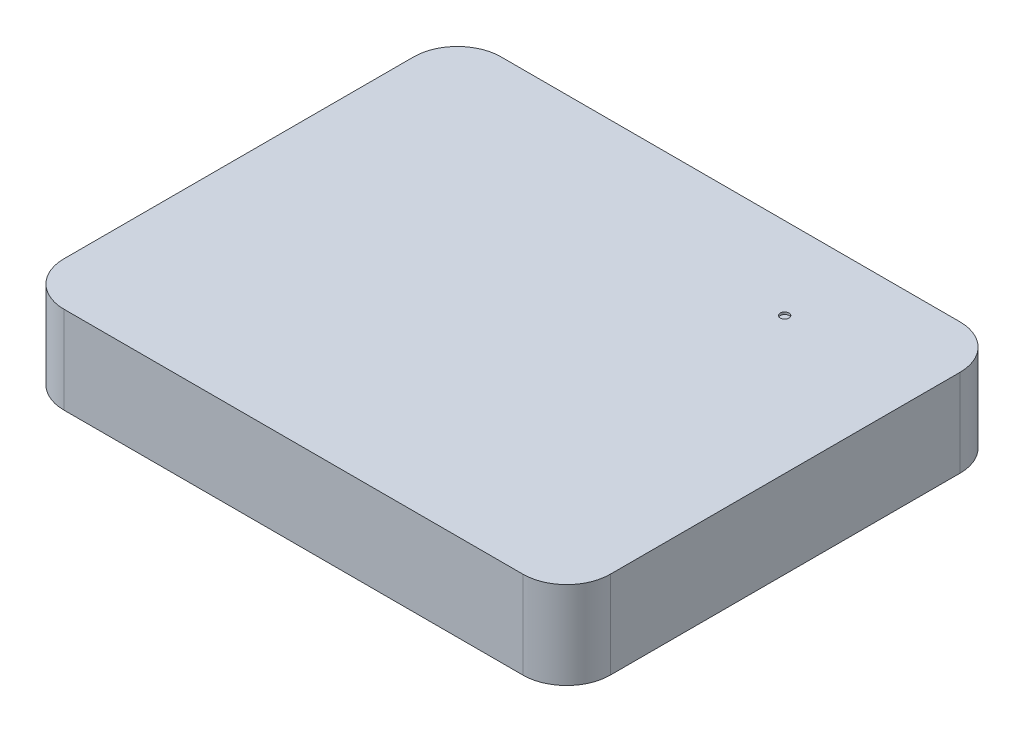
ISO-10303-21;
HEADER;
FILE_DESCRIPTION(('STEP AP214'),'2;1');
FILE_NAME('part.step','',(''),(''),'','','');
FILE_SCHEMA(('AUTOMOTIVE_DESIGN { 1 0 10303 214 1 1 1 1 }'));
ENDSEC;
DATA;
#1=APPLICATION_CONTEXT('core data for automotive mechanical design processes');
#2=APPLICATION_PROTOCOL_DEFINITION('international standard','automotive_design',2000,#1);
#3=PRODUCT_CONTEXT('',#1,'mechanical');
#4=PRODUCT('Part','Part','',(#3));
#5=PRODUCT_RELATED_PRODUCT_CATEGORY('part','',(#4));
#6=PRODUCT_DEFINITION_FORMATION('','',#4);
#7=PRODUCT_DEFINITION_CONTEXT('part definition',#1,'design');
#8=PRODUCT_DEFINITION('design','',#6,#7);
#9=PRODUCT_DEFINITION_SHAPE('','',#8);
#10=(LENGTH_UNIT() NAMED_UNIT(*) SI_UNIT(.MILLI.,.METRE.));
#11=(NAMED_UNIT(*) PLANE_ANGLE_UNIT() SI_UNIT($,.RADIAN.));
#12=(NAMED_UNIT(*) SI_UNIT($,.STERADIAN.) SOLID_ANGLE_UNIT());
#13=UNCERTAINTY_MEASURE_WITH_UNIT(LENGTH_MEASURE(1.E-05),#10,'distance_accuracy_value','');
#14=(GEOMETRIC_REPRESENTATION_CONTEXT(3) GLOBAL_UNCERTAINTY_ASSIGNED_CONTEXT((#13)) GLOBAL_UNIT_ASSIGNED_CONTEXT((#10,
#11,#12)) REPRESENTATION_CONTEXT('',''));
#15=CARTESIAN_POINT('',(0.,0.,0.));
#16=DIRECTION('',(0.,0.,1.));
#17=DIRECTION('',(1.,0.,0.));
#18=AXIS2_PLACEMENT_3D('',#15,#16,#17);
#19=CARTESIAN_POINT('',(-105.,40.,-80.));
#20=DIRECTION('',(0.,-1.,0.));
#21=DIRECTION('',(0.,0.,-1.));
#22=AXIS2_PLACEMENT_3D('',#19,#20,#21);
#23=CYLINDRICAL_SURFACE('',#22,20.);
#24=CARTESIAN_POINT('',(-105.,0.,-80.));
#25=DIRECTION('',(0.,1.,0.));
#26=DIRECTION('',(0.,0.,1.));
#27=AXIS2_PLACEMENT_3D('',#24,#25,#26);
#28=CIRCLE('',#27,20.);
#29=CARTESIAN_POINT('',(-105.,0.,-100.));
#30=VERTEX_POINT('',#29);
#31=CARTESIAN_POINT('',(-125.,0.,-79.9999999999999));
#32=VERTEX_POINT('',#31);
#33=EDGE_CURVE('E129',#30,#32,#28,.T.);
#34=ORIENTED_EDGE('',*,*,#33,.T.);
#35=DIRECTION('',(0.,-1.,0.));
#36=VECTOR('',#35,1.);
#37=CARTESIAN_POINT('',(-125.,40.,-79.9999999999999));
#38=LINE('',#37,#36);
#39=CARTESIAN_POINT('',(-125.,40.,-79.9999999999999));
#40=VERTEX_POINT('',#39);
#41=EDGE_CURVE('E11',#40,#32,#38,.T.);
#42=ORIENTED_EDGE('',*,*,#41,.F.);
#43=CARTESIAN_POINT('',(-105.,40.,-80.));
#44=DIRECTION('',(0.,1.,0.));
#45=DIRECTION('',(0.,0.,1.));
#46=AXIS2_PLACEMENT_3D('',#43,#44,#45);
#47=CIRCLE('',#46,20.);
#48=CARTESIAN_POINT('',(-105.,40.,-100.));
#49=VERTEX_POINT('',#48);
#50=EDGE_CURVE('E144',#49,#40,#47,.T.);
#51=ORIENTED_EDGE('',*,*,#50,.F.);
#52=DIRECTION('',(0.,-1.,0.));
#53=VECTOR('',#52,1.);
#54=CARTESIAN_POINT('',(-105.,40.,-100.));
#55=LINE('',#54,#53);
#56=EDGE_CURVE('E125',#49,#30,#55,.T.);
#57=ORIENTED_EDGE('',*,*,#56,.T.);
#58=EDGE_LOOP('',(#34,#42,#51,#57));
#59=FACE_BOUND('',#58,.T.);
#60=ADVANCED_FACE('F33',(#59),#23,.T.);
#61=CARTESIAN_POINT('',(-125.,40.,79.9999999999999));
#62=DIRECTION('',(1.,0.,0.));
#63=DIRECTION('',(0.,0.,-1.));
#64=AXIS2_PLACEMENT_3D('',#61,#62,#63);
#65=PLANE('',#64);
#66=DIRECTION('',(0.,0.,1.));
#67=VECTOR('',#66,1.);
#68=CARTESIAN_POINT('',(-125.,0.,79.9999999999999));
#69=LINE('',#68,#67);
#70=CARTESIAN_POINT('',(-125.,0.,79.9999999999999));
#71=VERTEX_POINT('',#70);
#72=EDGE_CURVE('E132',#32,#71,#69,.T.);
#73=ORIENTED_EDGE('',*,*,#72,.T.);
#74=DIRECTION('',(0.,-1.,0.));
#75=VECTOR('',#74,1.);
#76=CARTESIAN_POINT('',(-125.,40.,79.9999999999999));
#77=LINE('',#76,#75);
#78=CARTESIAN_POINT('',(-125.,40.,79.9999999999999));
#79=VERTEX_POINT('',#78);
#80=EDGE_CURVE('E41',#79,#71,#77,.T.);
#81=ORIENTED_EDGE('',*,*,#80,.F.);
#82=DIRECTION('',(0.,0.,1.));
#83=VECTOR('',#82,1.);
#84=CARTESIAN_POINT('',(-125.,40.,79.9999999999999));
#85=LINE('',#84,#83);
#86=EDGE_CURVE('E92',#40,#79,#85,.T.);
#87=ORIENTED_EDGE('',*,*,#86,.F.);
#88=ORIENTED_EDGE('',*,*,#41,.T.);
#89=EDGE_LOOP('',(#73,#81,#87,#88));
#90=FACE_BOUND('',#89,.T.);
#91=ADVANCED_FACE('F201',(#90),#65,.F.);
#92=CARTESIAN_POINT('',(-105.,40.,80.));
#93=DIRECTION('',(0.,-1.,0.));
#94=DIRECTION('',(0.,0.,-1.));
#95=AXIS2_PLACEMENT_3D('',#92,#93,#94);
#96=CYLINDRICAL_SURFACE('',#95,20.);
#97=CARTESIAN_POINT('',(-105.,0.,80.));
#98=DIRECTION('',(0.,1.,0.));
#99=DIRECTION('',(0.,0.,-1.));
#100=AXIS2_PLACEMENT_3D('',#97,#98,#99);
#101=CIRCLE('',#100,20.);
#102=CARTESIAN_POINT('',(-105.,0.,100.));
#103=VERTEX_POINT('',#102);
#104=EDGE_CURVE('E135',#71,#103,#101,.T.);
#105=ORIENTED_EDGE('',*,*,#104,.T.);
#106=DIRECTION('',(0.,-1.,0.));
#107=VECTOR('',#106,1.);
#108=CARTESIAN_POINT('',(-105.,40.,100.));
#109=LINE('',#108,#107);
#110=CARTESIAN_POINT('',(-105.,40.,100.));
#111=VERTEX_POINT('',#110);
#112=EDGE_CURVE('E151',#111,#103,#109,.T.);
#113=ORIENTED_EDGE('',*,*,#112,.F.);
#114=CARTESIAN_POINT('',(-105.,40.,80.));
#115=DIRECTION('',(0.,1.,0.));
#116=DIRECTION('',(0.,0.,-1.));
#117=AXIS2_PLACEMENT_3D('',#114,#115,#116);
#118=CIRCLE('',#117,20.);
#119=EDGE_CURVE('E159',#79,#111,#118,.T.);
#120=ORIENTED_EDGE('',*,*,#119,.F.);
#121=ORIENTED_EDGE('',*,*,#80,.T.);
#122=EDGE_LOOP('',(#105,#113,#120,#121));
#123=FACE_BOUND('',#122,.T.);
#124=ADVANCED_FACE('F157',(#123),#96,.T.);
#125=CARTESIAN_POINT('',(105.,40.,100.));
#126=DIRECTION('',(0.,0.,-1.));
#127=DIRECTION('',(-1.,0.,0.));
#128=AXIS2_PLACEMENT_3D('',#125,#126,#127);
#129=PLANE('',#128);
#130=DIRECTION('',(1.,0.,0.));
#131=VECTOR('',#130,1.);
#132=CARTESIAN_POINT('',(105.,0.,100.));
#133=LINE('',#132,#131);
#134=CARTESIAN_POINT('',(105.,0.,100.));
#135=VERTEX_POINT('',#134);
#136=EDGE_CURVE('E137',#103,#135,#133,.T.);
#137=ORIENTED_EDGE('',*,*,#136,.T.);
#138=DIRECTION('',(0.,-1.,0.));
#139=VECTOR('',#138,1.);
#140=CARTESIAN_POINT('',(105.,40.,100.));
#141=LINE('',#140,#139);
#142=CARTESIAN_POINT('',(105.,40.,100.));
#143=VERTEX_POINT('',#142);
#144=EDGE_CURVE('E148',#143,#135,#141,.T.);
#145=ORIENTED_EDGE('',*,*,#144,.F.);
#146=DIRECTION('',(1.,0.,0.));
#147=VECTOR('',#146,1.);
#148=CARTESIAN_POINT('',(105.,40.,100.));
#149=LINE('',#148,#147);
#150=EDGE_CURVE('E171',#111,#143,#149,.T.);
#151=ORIENTED_EDGE('',*,*,#150,.F.);
#152=ORIENTED_EDGE('',*,*,#112,.T.);
#153=EDGE_LOOP('',(#137,#145,#151,#152));
#154=FACE_BOUND('',#153,.T.);
#155=ADVANCED_FACE('F167',(#154),#129,.F.);
#156=CARTESIAN_POINT('',(105.,40.,80.));
#157=DIRECTION('',(0.,-1.,0.));
#158=DIRECTION('',(0.,0.,-1.));
#159=AXIS2_PLACEMENT_3D('',#156,#157,#158);
#160=CYLINDRICAL_SURFACE('',#159,20.);
#161=CARTESIAN_POINT('',(105.,0.,80.));
#162=DIRECTION('',(0.,1.,0.));
#163=DIRECTION('',(0.,0.,1.));
#164=AXIS2_PLACEMENT_3D('',#161,#162,#163);
#165=CIRCLE('',#164,20.);
#166=CARTESIAN_POINT('',(125.,0.,79.9999999999998));
#167=VERTEX_POINT('',#166);
#168=EDGE_CURVE('E139',#135,#167,#165,.T.);
#169=ORIENTED_EDGE('',*,*,#168,.T.);
#170=DIRECTION('',(0.,-1.,0.));
#171=VECTOR('',#170,1.);
#172=CARTESIAN_POINT('',(125.,40.,79.9999999999998));
#173=LINE('',#172,#171);
#174=CARTESIAN_POINT('',(125.,40.,79.9999999999998));
#175=VERTEX_POINT('',#174);
#176=EDGE_CURVE('E120',#175,#167,#173,.T.);
#177=ORIENTED_EDGE('',*,*,#176,.F.);
#178=CARTESIAN_POINT('',(105.,40.,80.));
#179=DIRECTION('',(0.,1.,0.));
#180=DIRECTION('',(0.,0.,1.));
#181=AXIS2_PLACEMENT_3D('',#178,#179,#180);
#182=CIRCLE('',#181,20.);
#183=EDGE_CURVE('E111',#143,#175,#182,.T.);
#184=ORIENTED_EDGE('',*,*,#183,.F.);
#185=ORIENTED_EDGE('',*,*,#144,.T.);
#186=EDGE_LOOP('',(#169,#177,#184,#185));
#187=FACE_BOUND('',#186,.T.);
#188=ADVANCED_FACE('F170',(#187),#160,.T.);
#189=CARTESIAN_POINT('',(125.,40.,79.9999999999998));
#190=DIRECTION('',(-1.,0.,0.));
#191=DIRECTION('',(0.,0.,1.));
#192=AXIS2_PLACEMENT_3D('',#189,#190,#191);
#193=PLANE('',#192);
#194=DIRECTION('',(0.,0.,-1.));
#195=VECTOR('',#194,1.);
#196=CARTESIAN_POINT('',(125.,0.,79.9999999999998));
#197=LINE('',#196,#195);
#198=CARTESIAN_POINT('',(125.,0.,-79.9999999999999));
#199=VERTEX_POINT('',#198);
#200=EDGE_CURVE('E119',#167,#199,#197,.T.);
#201=ORIENTED_EDGE('',*,*,#200,.T.);
#202=DIRECTION('',(0.,-1.,0.));
#203=VECTOR('',#202,1.);
#204=CARTESIAN_POINT('',(125.,40.,-79.9999999999999));
#205=LINE('',#204,#203);
#206=CARTESIAN_POINT('',(125.,40.,-79.9999999999999));
#207=VERTEX_POINT('',#206);
#208=EDGE_CURVE('E116',#207,#199,#205,.T.);
#209=ORIENTED_EDGE('',*,*,#208,.F.);
#210=DIRECTION('',(0.,0.,-1.));
#211=VECTOR('',#210,1.);
#212=CARTESIAN_POINT('',(125.,40.,79.9999999999998));
#213=LINE('',#212,#211);
#214=EDGE_CURVE('E105',#175,#207,#213,.T.);
#215=ORIENTED_EDGE('',*,*,#214,.F.);
#216=ORIENTED_EDGE('',*,*,#176,.T.);
#217=EDGE_LOOP('',(#201,#209,#215,#216));
#218=FACE_BOUND('',#217,.T.);
#219=ADVANCED_FACE('F117',(#218),#193,.F.);
#220=CARTESIAN_POINT('',(105.,40.,-80.));
#221=DIRECTION('',(0.,-1.,0.));
#222=DIRECTION('',(0.,0.,-1.));
#223=AXIS2_PLACEMENT_3D('',#220,#221,#222);
#224=CYLINDRICAL_SURFACE('',#223,20.);
#225=CARTESIAN_POINT('',(105.,0.,-80.));
#226=DIRECTION('',(0.,1.,0.));
#227=DIRECTION('',(0.,0.,1.));
#228=AXIS2_PLACEMENT_3D('',#225,#226,#227);
#229=CIRCLE('',#228,20.);
#230=CARTESIAN_POINT('',(105.,0.,-100.));
#231=VERTEX_POINT('',#230);
#232=EDGE_CURVE('E78',#199,#231,#229,.T.);
#233=ORIENTED_EDGE('',*,*,#232,.T.);
#234=DIRECTION('',(0.,-1.,0.));
#235=VECTOR('',#234,1.);
#236=CARTESIAN_POINT('',(105.,40.,-100.));
#237=LINE('',#236,#235);
#238=CARTESIAN_POINT('',(105.,40.,-100.));
#239=VERTEX_POINT('',#238);
#240=EDGE_CURVE('E121',#239,#231,#237,.T.);
#241=ORIENTED_EDGE('',*,*,#240,.F.);
#242=CARTESIAN_POINT('',(105.,40.,-80.));
#243=DIRECTION('',(0.,1.,0.));
#244=DIRECTION('',(0.,0.,1.));
#245=AXIS2_PLACEMENT_3D('',#242,#243,#244);
#246=CIRCLE('',#245,20.);
#247=EDGE_CURVE('E109',#207,#239,#246,.T.);
#248=ORIENTED_EDGE('',*,*,#247,.F.);
#249=ORIENTED_EDGE('',*,*,#208,.T.);
#250=EDGE_LOOP('',(#233,#241,#248,#249));
#251=FACE_BOUND('',#250,.T.);
#252=ADVANCED_FACE('F123',(#251),#224,.T.);
#253=CARTESIAN_POINT('',(105.,40.,-100.));
#254=DIRECTION('',(0.,0.,1.));
#255=DIRECTION('',(1.,0.,0.));
#256=AXIS2_PLACEMENT_3D('',#253,#254,#255);
#257=PLANE('',#256);
#258=DIRECTION('',(-1.,0.,0.));
#259=VECTOR('',#258,1.);
#260=CARTESIAN_POINT('',(105.,0.,-100.));
#261=LINE('',#260,#259);
#262=EDGE_CURVE('E84',#231,#30,#261,.T.);
#263=ORIENTED_EDGE('',*,*,#262,.T.);
#264=ORIENTED_EDGE('',*,*,#56,.F.);
#265=DIRECTION('',(-1.,0.,0.));
#266=VECTOR('',#265,1.);
#267=CARTESIAN_POINT('',(105.,40.,-100.));
#268=LINE('',#267,#266);
#269=EDGE_CURVE('E49',#239,#49,#268,.T.);
#270=ORIENTED_EDGE('',*,*,#269,.F.);
#271=ORIENTED_EDGE('',*,*,#240,.T.);
#272=EDGE_LOOP('',(#263,#264,#270,#271));
#273=FACE_BOUND('',#272,.T.);
#274=ADVANCED_FACE('F192',(#273),#257,.F.);
#275=CARTESIAN_POINT('',(-105.,40.,-80.));
#276=DIRECTION('',(0.,1.,0.));
#277=DIRECTION('',(0.,0.,1.));
#278=AXIS2_PLACEMENT_3D('',#275,#276,#277);
#279=PLANE('',#278);
#280=CARTESIAN_POINT('',(62.3674592684266,40.,-62.3674592684268));
#281=DIRECTION('',(0.,1.,0.));
#282=DIRECTION('',(0.,0.,1.));
#283=AXIS2_PLACEMENT_3D('',#280,#281,#282);
#284=CIRCLE('',#283,2.);
#285=CARTESIAN_POINT('',(62.3674592684266,40.,-60.3674592684268));
#286=VERTEX_POINT('',#285);
#287=EDGE_CURVE('E177',#286,#286,#284,.T.);
#288=ORIENTED_EDGE('',*,*,#287,.F.);
#289=EDGE_LOOP('',(#288));
#290=FACE_BOUND('',#289,.T.);
#291=ORIENTED_EDGE('',*,*,#50,.T.);
#292=ORIENTED_EDGE('',*,*,#86,.T.);
#293=ORIENTED_EDGE('',*,*,#119,.T.);
#294=ORIENTED_EDGE('',*,*,#150,.T.);
#295=ORIENTED_EDGE('',*,*,#183,.T.);
#296=ORIENTED_EDGE('',*,*,#214,.T.);
#297=ORIENTED_EDGE('',*,*,#247,.T.);
#298=ORIENTED_EDGE('',*,*,#269,.T.);
#299=EDGE_LOOP('',(#291,#292,#293,#294,#295,#296,#297,#298));
#300=FACE_BOUND('',#299,.T.);
#301=ADVANCED_FACE('F107',(#290,#300),#279,.T.);
#302=CARTESIAN_POINT('',(-105.,0.,-80.));
#303=DIRECTION('',(0.,1.,0.));
#304=DIRECTION('',(0.,0.,1.));
#305=AXIS2_PLACEMENT_3D('',#302,#303,#304);
#306=PLANE('',#305);
#307=ORIENTED_EDGE('',*,*,#33,.F.);
#308=ORIENTED_EDGE('',*,*,#262,.F.);
#309=ORIENTED_EDGE('',*,*,#232,.F.);
#310=ORIENTED_EDGE('',*,*,#200,.F.);
#311=ORIENTED_EDGE('',*,*,#168,.F.);
#312=ORIENTED_EDGE('',*,*,#136,.F.);
#313=ORIENTED_EDGE('',*,*,#104,.F.);
#314=ORIENTED_EDGE('',*,*,#72,.F.);
#315=EDGE_LOOP('',(#307,#308,#309,#310,#311,#312,#313,#314));
#316=FACE_BOUND('',#315,.T.);
#317=ADVANCED_FACE('F163',(#316),#306,.F.);
#318=CARTESIAN_POINT('',(62.3674592684266,39.,-62.3674592684268));
#319=DIRECTION('',(0.,1.,0.));
#320=DIRECTION('',(0.,0.,1.));
#321=AXIS2_PLACEMENT_3D('',#318,#319,#320);
#322=CYLINDRICAL_SURFACE('',#321,2.);
#323=CARTESIAN_POINT('',(62.3674592684266,39.,-62.3674592684268));
#324=DIRECTION('',(0.,1.,0.));
#325=DIRECTION('',(0.,0.,1.));
#326=AXIS2_PLACEMENT_3D('',#323,#324,#325);
#327=CIRCLE('',#326,2.);
#328=CARTESIAN_POINT('',(62.3674592684266,39.,-60.3674592684268));
#329=VERTEX_POINT('',#328);
#330=EDGE_CURVE('E133',#329,#329,#327,.T.);
#331=ORIENTED_EDGE('',*,*,#330,.F.);
#332=EDGE_LOOP('',(#331));
#333=FACE_BOUND('',#332,.T.);
#334=ORIENTED_EDGE('',*,*,#287,.T.);
#335=EDGE_LOOP('',(#334));
#336=FACE_BOUND('',#335,.T.);
#337=ADVANCED_FACE('F185',(#333,#336),#322,.F.);
#338=CARTESIAN_POINT('',(62.3674592684266,39.,-62.3674592684268));
#339=DIRECTION('',(0.,1.,0.));
#340=DIRECTION('',(0.,0.,1.));
#341=AXIS2_PLACEMENT_3D('',#338,#339,#340);
#342=PLANE('',#341);
#343=ORIENTED_EDGE('',*,*,#330,.T.);
#344=EDGE_LOOP('',(#343));
#345=FACE_BOUND('',#344,.T.);
#346=ADVANCED_FACE('F183',(#345),#342,.T.);
#347=CLOSED_SHELL('',(#60,#91,#124,#155,#188,#219,#252,#274,#301,#317,#337,#346));
#348=MANIFOLD_SOLID_BREP('B2',#347);
#349=ADVANCED_BREP_SHAPE_REPRESENTATION('',(#18,#348),#14);
#350=SHAPE_DEFINITION_REPRESENTATION(#9,#349);
ENDSEC;
END-ISO-10303-21;
